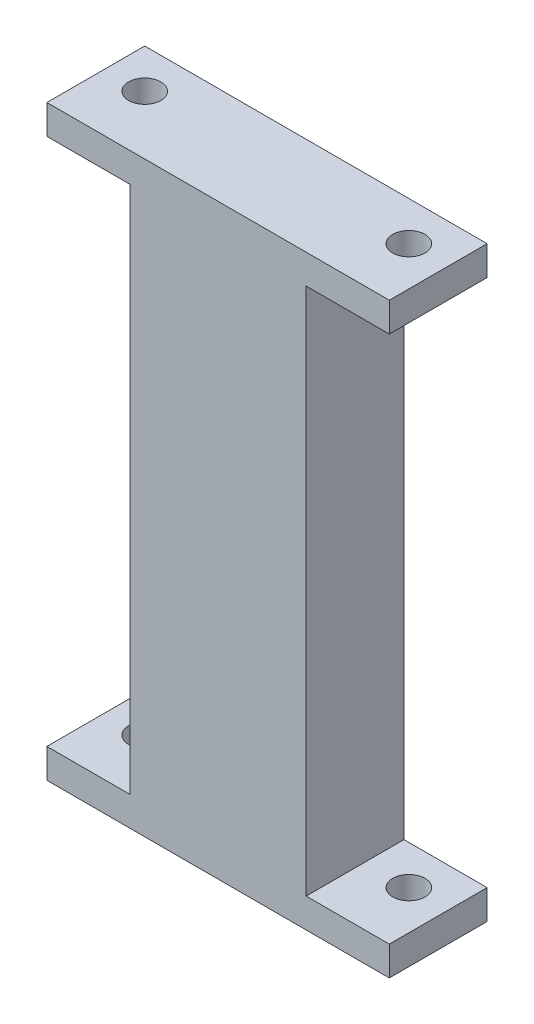
ISO-10303-21;
HEADER;
FILE_DESCRIPTION(('STEP AP214'),'2;1');
FILE_NAME('part.step','',(''),(''),'','','');
FILE_SCHEMA(('AUTOMOTIVE_DESIGN { 1 0 10303 214 1 1 1 1 }'));
ENDSEC;
DATA;
#1=APPLICATION_CONTEXT('core data for automotive mechanical design processes');
#2=APPLICATION_PROTOCOL_DEFINITION('international standard','automotive_design',2000,#1);
#3=PRODUCT_CONTEXT('',#1,'mechanical');
#4=PRODUCT('Part','Part','',(#3));
#5=PRODUCT_RELATED_PRODUCT_CATEGORY('part','',(#4));
#6=PRODUCT_DEFINITION_FORMATION('','',#4);
#7=PRODUCT_DEFINITION_CONTEXT('part definition',#1,'design');
#8=PRODUCT_DEFINITION('design','',#6,#7);
#9=PRODUCT_DEFINITION_SHAPE('','',#8);
#10=(LENGTH_UNIT() NAMED_UNIT(*) SI_UNIT(.MILLI.,.METRE.));
#11=(NAMED_UNIT(*) PLANE_ANGLE_UNIT() SI_UNIT($,.RADIAN.));
#12=(NAMED_UNIT(*) SI_UNIT($,.STERADIAN.) SOLID_ANGLE_UNIT());
#13=UNCERTAINTY_MEASURE_WITH_UNIT(LENGTH_MEASURE(1.E-05),#10,'distance_accuracy_value','');
#14=(GEOMETRIC_REPRESENTATION_CONTEXT(3) GLOBAL_UNCERTAINTY_ASSIGNED_CONTEXT((#13)) GLOBAL_UNIT_ASSIGNED_CONTEXT((#10,
#11,#12)) REPRESENTATION_CONTEXT('',''));
#15=CARTESIAN_POINT('',(0.,0.,0.));
#16=DIRECTION('',(0.,0.,1.));
#17=DIRECTION('',(1.,0.,0.));
#18=AXIS2_PLACEMENT_3D('',#15,#16,#17);
#19=CARTESIAN_POINT('',(0.,1.5,0.));
#20=DIRECTION('',(0.,-1.,0.));
#21=DIRECTION('',(0.,0.,-1.));
#22=AXIS2_PLACEMENT_3D('',#19,#20,#21);
#23=PLANE('',#22);
#24=CARTESIAN_POINT('',(-13.5,1.5,-0.999999999999997));
#25=DIRECTION('',(0.,1.,0.));
#26=DIRECTION('',(0.,0.,1.));
#27=AXIS2_PLACEMENT_3D('',#24,#25,#26);
#28=CIRCLE('',#27,1.65);
#29=CARTESIAN_POINT('',(-13.5,1.5,0.650000000000004));
#30=VERTEX_POINT('',#29);
#31=EDGE_CURVE('E196',#30,#30,#28,.T.);
#32=ORIENTED_EDGE('',*,*,#31,.F.);
#33=EDGE_LOOP('',(#32));
#34=FACE_BOUND('',#33,.T.);
#35=DIRECTION('',(0.,0.,1.));
#36=VECTOR('',#35,1.);
#37=CARTESIAN_POINT('',(-9.,1.5,-5.));
#38=LINE('',#37,#36);
#39=CARTESIAN_POINT('',(-9.,1.5,-5.));
#40=VERTEX_POINT('',#39);
#41=CARTESIAN_POINT('',(-9.,1.5,5.));
#42=VERTEX_POINT('',#41);
#43=EDGE_CURVE('E146',#40,#42,#38,.T.);
#44=ORIENTED_EDGE('',*,*,#43,.F.);
#45=DIRECTION('',(-1.,0.,0.));
#46=VECTOR('',#45,1.);
#47=CARTESIAN_POINT('',(-17.5,1.5,-5.));
#48=LINE('',#47,#46);
#49=CARTESIAN_POINT('',(-17.5,1.5,-5.));
#50=VERTEX_POINT('',#49);
#51=EDGE_CURVE('E211',#40,#50,#48,.T.);
#52=ORIENTED_EDGE('',*,*,#51,.T.);
#53=DIRECTION('',(0.,0.,1.));
#54=VECTOR('',#53,1.);
#55=CARTESIAN_POINT('',(-17.5,1.5,5.));
#56=LINE('',#55,#54);
#57=CARTESIAN_POINT('',(-17.5,1.5,5.));
#58=VERTEX_POINT('',#57);
#59=EDGE_CURVE('E215',#50,#58,#56,.T.);
#60=ORIENTED_EDGE('',*,*,#59,.T.);
#61=DIRECTION('',(1.,0.,0.));
#62=VECTOR('',#61,1.);
#63=CARTESIAN_POINT('',(-17.5,1.5,5.));
#64=LINE('',#63,#62);
#65=EDGE_CURVE('E59',#58,#42,#64,.T.);
#66=ORIENTED_EDGE('',*,*,#65,.T.);
#67=EDGE_LOOP('',(#44,#52,#60,#66));
#68=FACE_BOUND('',#67,.T.);
#69=ADVANCED_FACE('F36',(#34,#68),#23,.F.);
#70=CARTESIAN_POINT('',(13.5,1.5,-1.));
#71=DIRECTION('',(0.,1.,0.));
#72=DIRECTION('',(0.,0.,-1.));
#73=AXIS2_PLACEMENT_3D('',#70,#71,#72);
#74=CIRCLE('',#73,1.65);
#75=CARTESIAN_POINT('',(13.5,1.5,-2.65));
#76=VERTEX_POINT('',#75);
#77=EDGE_CURVE('E195',#76,#76,#74,.T.);
#78=ORIENTED_EDGE('',*,*,#77,.F.);
#79=EDGE_LOOP('',(#78));
#80=FACE_BOUND('',#79,.T.);
#81=DIRECTION('',(0.,0.,-1.));
#82=VECTOR('',#81,1.);
#83=CARTESIAN_POINT('',(9.,1.5,-5.));
#84=LINE('',#83,#82);
#85=CARTESIAN_POINT('',(8.99999999999999,1.5,5.));
#86=VERTEX_POINT('',#85);
#87=CARTESIAN_POINT('',(9.,1.5,-5.));
#88=VERTEX_POINT('',#87);
#89=EDGE_CURVE('E51',#86,#88,#84,.T.);
#90=ORIENTED_EDGE('',*,*,#89,.F.);
#91=CARTESIAN_POINT('',(17.5,1.5,5.));
#92=VERTEX_POINT('',#91);
#93=EDGE_CURVE('E217',#86,#92,#64,.T.);
#94=ORIENTED_EDGE('',*,*,#93,.T.);
#95=DIRECTION('',(0.,0.,-1.));
#96=VECTOR('',#95,1.);
#97=CARTESIAN_POINT('',(17.5,1.5,5.));
#98=LINE('',#97,#96);
#99=CARTESIAN_POINT('',(17.5,1.5,-5.));
#100=VERTEX_POINT('',#99);
#101=EDGE_CURVE('E208',#92,#100,#98,.T.);
#102=ORIENTED_EDGE('',*,*,#101,.T.);
#103=EDGE_CURVE('E213',#100,#88,#48,.T.);
#104=ORIENTED_EDGE('',*,*,#103,.T.);
#105=EDGE_LOOP('',(#90,#94,#102,#104));
#106=FACE_BOUND('',#105,.T.);
#107=ADVANCED_FACE('F248',(#80,#106),#23,.F.);
#108=CARTESIAN_POINT('',(17.5,1.5,5.));
#109=DIRECTION('',(-1.,0.,0.));
#110=DIRECTION('',(0.,0.,1.));
#111=AXIS2_PLACEMENT_3D('',#108,#109,#110);
#112=PLANE('',#111);
#113=DIRECTION('',(0.,0.,-1.));
#114=VECTOR('',#113,1.);
#115=CARTESIAN_POINT('',(17.5,-1.5,5.));
#116=LINE('',#115,#114);
#117=CARTESIAN_POINT('',(17.5,-1.5,5.));
#118=VERTEX_POINT('',#117);
#119=CARTESIAN_POINT('',(17.5,-1.5,-5.));
#120=VERTEX_POINT('',#119);
#121=EDGE_CURVE('E203',#118,#120,#116,.T.);
#122=ORIENTED_EDGE('',*,*,#121,.T.);
#123=DIRECTION('',(0.,-1.,0.));
#124=VECTOR('',#123,1.);
#125=CARTESIAN_POINT('',(17.5,1.5,-5.));
#126=LINE('',#125,#124);
#127=EDGE_CURVE('E11',#100,#120,#126,.T.);
#128=ORIENTED_EDGE('',*,*,#127,.F.);
#129=ORIENTED_EDGE('',*,*,#101,.F.);
#130=DIRECTION('',(0.,-1.,0.));
#131=VECTOR('',#130,1.);
#132=CARTESIAN_POINT('',(17.5,1.5,5.));
#133=LINE('',#132,#131);
#134=EDGE_CURVE('E219',#92,#118,#133,.T.);
#135=ORIENTED_EDGE('',*,*,#134,.T.);
#136=EDGE_LOOP('',(#122,#128,#129,#135));
#137=FACE_BOUND('',#136,.T.);
#138=ADVANCED_FACE('F38',(#137),#112,.F.);
#139=CARTESIAN_POINT('',(-17.5,1.5,-5.));
#140=DIRECTION('',(0.,0.,1.));
#141=DIRECTION('',(1.,0.,0.));
#142=AXIS2_PLACEMENT_3D('',#139,#140,#141);
#143=PLANE('',#142);
#144=DIRECTION('',(-1.,0.,0.));
#145=VECTOR('',#144,1.);
#146=CARTESIAN_POINT('',(-17.5,-1.5,-5.));
#147=LINE('',#146,#145);
#148=CARTESIAN_POINT('',(-17.5,-1.5,-5.));
#149=VERTEX_POINT('',#148);
#150=EDGE_CURVE('E222',#120,#149,#147,.T.);
#151=ORIENTED_EDGE('',*,*,#150,.T.);
#152=DIRECTION('',(0.,-1.,0.));
#153=VECTOR('',#152,1.);
#154=CARTESIAN_POINT('',(-17.5,1.5,-5.));
#155=LINE('',#154,#153);
#156=EDGE_CURVE('E44',#50,#149,#155,.T.);
#157=ORIENTED_EDGE('',*,*,#156,.F.);
#158=ORIENTED_EDGE('',*,*,#51,.F.);
#159=DIRECTION('',(0.,-1.,0.));
#160=VECTOR('',#159,1.);
#161=CARTESIAN_POINT('',(-9.,55.5,-5.));
#162=LINE('',#161,#160);
#163=CARTESIAN_POINT('',(-9.,55.5,-5.));
#164=VERTEX_POINT('',#163);
#165=EDGE_CURVE('E183',#164,#40,#162,.T.);
#166=ORIENTED_EDGE('',*,*,#165,.F.);
#167=DIRECTION('',(-1.,0.,0.));
#168=VECTOR('',#167,1.);
#169=CARTESIAN_POINT('',(-17.5,55.5,-5.));
#170=LINE('',#169,#168);
#171=CARTESIAN_POINT('',(-17.5,55.5,-5.));
#172=VERTEX_POINT('',#171);
#173=EDGE_CURVE('E165',#164,#172,#170,.T.);
#174=ORIENTED_EDGE('',*,*,#173,.T.);
#175=DIRECTION('',(0.,1.,0.));
#176=VECTOR('',#175,1.);
#177=CARTESIAN_POINT('',(-17.5,55.5,-5.));
#178=LINE('',#177,#176);
#179=CARTESIAN_POINT('',(-17.5,58.5,-5.));
#180=VERTEX_POINT('',#179);
#181=EDGE_CURVE('E175',#172,#180,#178,.T.);
#182=ORIENTED_EDGE('',*,*,#181,.T.);
#183=DIRECTION('',(-1.,0.,0.));
#184=VECTOR('',#183,1.);
#185=CARTESIAN_POINT('',(-17.5,58.5,-5.));
#186=LINE('',#185,#184);
#187=CARTESIAN_POINT('',(17.5,58.5,-5.));
#188=VERTEX_POINT('',#187);
#189=EDGE_CURVE('E152',#188,#180,#186,.T.);
#190=ORIENTED_EDGE('',*,*,#189,.F.);
#191=DIRECTION('',(0.,1.,0.));
#192=VECTOR('',#191,1.);
#193=CARTESIAN_POINT('',(17.5,55.5,-5.));
#194=LINE('',#193,#192);
#195=CARTESIAN_POINT('',(17.5,55.5,-5.));
#196=VERTEX_POINT('',#195);
#197=EDGE_CURVE('E167',#196,#188,#194,.T.);
#198=ORIENTED_EDGE('',*,*,#197,.F.);
#199=CARTESIAN_POINT('',(8.99999999999999,55.5,-5.));
#200=VERTEX_POINT('',#199);
#201=EDGE_CURVE('E151',#196,#200,#170,.T.);
#202=ORIENTED_EDGE('',*,*,#201,.T.);
#203=DIRECTION('',(0.,-1.,0.));
#204=VECTOR('',#203,1.);
#205=CARTESIAN_POINT('',(9.,55.5,-5.));
#206=LINE('',#205,#204);
#207=EDGE_CURVE('E189',#200,#88,#206,.T.);
#208=ORIENTED_EDGE('',*,*,#207,.T.);
#209=ORIENTED_EDGE('',*,*,#103,.F.);
#210=ORIENTED_EDGE('',*,*,#127,.T.);
#211=EDGE_LOOP('',(#151,#157,#158,#166,#174,#182,#190,#198,#202,#208,#209,#210));
#212=FACE_BOUND('',#211,.T.);
#213=ADVANCED_FACE('F251',(#212),#143,.F.);
#214=CARTESIAN_POINT('',(-17.5,1.5,5.));
#215=DIRECTION('',(1.,0.,0.));
#216=DIRECTION('',(0.,0.,-1.));
#217=AXIS2_PLACEMENT_3D('',#214,#215,#216);
#218=PLANE('',#217);
#219=DIRECTION('',(0.,0.,1.));
#220=VECTOR('',#219,1.);
#221=CARTESIAN_POINT('',(-17.5,-1.5,5.));
#222=LINE('',#221,#220);
#223=CARTESIAN_POINT('',(-17.5,-1.5,5.));
#224=VERTEX_POINT('',#223);
#225=EDGE_CURVE('E224',#149,#224,#222,.T.);
#226=ORIENTED_EDGE('',*,*,#225,.T.);
#227=DIRECTION('',(0.,-1.,0.));
#228=VECTOR('',#227,1.);
#229=CARTESIAN_POINT('',(-17.5,1.5,5.));
#230=LINE('',#229,#228);
#231=EDGE_CURVE('E229',#58,#224,#230,.T.);
#232=ORIENTED_EDGE('',*,*,#231,.F.);
#233=ORIENTED_EDGE('',*,*,#59,.F.);
#234=ORIENTED_EDGE('',*,*,#156,.T.);
#235=EDGE_LOOP('',(#226,#232,#233,#234));
#236=FACE_BOUND('',#235,.T.);
#237=ADVANCED_FACE('F236',(#236),#218,.F.);
#238=CARTESIAN_POINT('',(-17.5,1.5,5.));
#239=DIRECTION('',(0.,0.,-1.));
#240=DIRECTION('',(-1.,0.,0.));
#241=AXIS2_PLACEMENT_3D('',#238,#239,#240);
#242=PLANE('',#241);
#243=DIRECTION('',(1.,0.,0.));
#244=VECTOR('',#243,1.);
#245=CARTESIAN_POINT('',(-17.5,-1.5,5.));
#246=LINE('',#245,#244);
#247=EDGE_CURVE('E212',#224,#118,#246,.T.);
#248=ORIENTED_EDGE('',*,*,#247,.T.);
#249=ORIENTED_EDGE('',*,*,#134,.F.);
#250=ORIENTED_EDGE('',*,*,#93,.F.);
#251=DIRECTION('',(0.,-1.,0.));
#252=VECTOR('',#251,1.);
#253=CARTESIAN_POINT('',(9.,55.5,5.));
#254=LINE('',#253,#252);
#255=CARTESIAN_POINT('',(9.,55.5,5.));
#256=VERTEX_POINT('',#255);
#257=EDGE_CURVE('E131',#256,#86,#254,.T.);
#258=ORIENTED_EDGE('',*,*,#257,.F.);
#259=DIRECTION('',(1.,0.,0.));
#260=VECTOR('',#259,1.);
#261=CARTESIAN_POINT('',(-17.5,55.5,5.));
#262=LINE('',#261,#260);
#263=CARTESIAN_POINT('',(17.5,55.5,5.));
#264=VERTEX_POINT('',#263);
#265=EDGE_CURVE('E124',#256,#264,#262,.T.);
#266=ORIENTED_EDGE('',*,*,#265,.T.);
#267=DIRECTION('',(0.,1.,0.));
#268=VECTOR('',#267,1.);
#269=CARTESIAN_POINT('',(17.5,55.5,5.));
#270=LINE('',#269,#268);
#271=CARTESIAN_POINT('',(17.5,58.5,5.));
#272=VERTEX_POINT('',#271);
#273=EDGE_CURVE('E128',#264,#272,#270,.T.);
#274=ORIENTED_EDGE('',*,*,#273,.T.);
#275=DIRECTION('',(1.,0.,0.));
#276=VECTOR('',#275,1.);
#277=CARTESIAN_POINT('',(-17.5,58.5,5.));
#278=LINE('',#277,#276);
#279=CARTESIAN_POINT('',(-17.5,58.5,5.));
#280=VERTEX_POINT('',#279);
#281=EDGE_CURVE('E169',#280,#272,#278,.T.);
#282=ORIENTED_EDGE('',*,*,#281,.F.);
#283=DIRECTION('',(0.,1.,0.));
#284=VECTOR('',#283,1.);
#285=CARTESIAN_POINT('',(-17.5,55.5,5.));
#286=LINE('',#285,#284);
#287=CARTESIAN_POINT('',(-17.5,55.5,5.));
#288=VERTEX_POINT('',#287);
#289=EDGE_CURVE('E147',#288,#280,#286,.T.);
#290=ORIENTED_EDGE('',*,*,#289,.F.);
#291=CARTESIAN_POINT('',(-9.,55.5,5.));
#292=VERTEX_POINT('',#291);
#293=EDGE_CURVE('E136',#288,#292,#262,.T.);
#294=ORIENTED_EDGE('',*,*,#293,.T.);
#295=DIRECTION('',(0.,-1.,0.));
#296=VECTOR('',#295,1.);
#297=CARTESIAN_POINT('',(-9.,55.5,5.));
#298=LINE('',#297,#296);
#299=EDGE_CURVE('E193',#292,#42,#298,.T.);
#300=ORIENTED_EDGE('',*,*,#299,.T.);
#301=ORIENTED_EDGE('',*,*,#65,.F.);
#302=ORIENTED_EDGE('',*,*,#231,.T.);
#303=EDGE_LOOP('',(#248,#249,#250,#258,#266,#274,#282,#290,#294,#300,#301,#302));
#304=FACE_BOUND('',#303,.T.);
#305=ADVANCED_FACE('F126',(#304),#242,.F.);
#306=CARTESIAN_POINT('',(0.,-1.5,0.));
#307=DIRECTION('',(0.,-1.,0.));
#308=DIRECTION('',(0.,0.,-1.));
#309=AXIS2_PLACEMENT_3D('',#306,#307,#308);
#310=PLANE('',#309);
#311=CARTESIAN_POINT('',(-13.5,-1.5,-0.999999999999997));
#312=DIRECTION('',(0.,-1.,0.));
#313=DIRECTION('',(0.,0.,-1.));
#314=AXIS2_PLACEMENT_3D('',#311,#312,#313);
#315=CIRCLE('',#314,1.65);
#316=CARTESIAN_POINT('',(-13.5,-1.5,-2.65));
#317=VERTEX_POINT('',#316);
#318=EDGE_CURVE('E199',#317,#317,#315,.F.);
#319=ORIENTED_EDGE('',*,*,#318,.T.);
#320=EDGE_LOOP('',(#319));
#321=FACE_BOUND('',#320,.T.);
#322=CARTESIAN_POINT('',(13.5,-1.5,-1.));
#323=DIRECTION('',(0.,-1.,0.));
#324=DIRECTION('',(0.,0.,-1.));
#325=AXIS2_PLACEMENT_3D('',#322,#323,#324);
#326=CIRCLE('',#325,1.65);
#327=CARTESIAN_POINT('',(13.5,-1.5,-2.65));
#328=VERTEX_POINT('',#327);
#329=EDGE_CURVE('E200',#328,#328,#326,.F.);
#330=ORIENTED_EDGE('',*,*,#329,.T.);
#331=EDGE_LOOP('',(#330));
#332=FACE_BOUND('',#331,.T.);
#333=ORIENTED_EDGE('',*,*,#121,.F.);
#334=ORIENTED_EDGE('',*,*,#247,.F.);
#335=ORIENTED_EDGE('',*,*,#225,.F.);
#336=ORIENTED_EDGE('',*,*,#150,.F.);
#337=EDGE_LOOP('',(#333,#334,#335,#336));
#338=FACE_BOUND('',#337,.T.);
#339=ADVANCED_FACE('F243',(#321,#332,#338),#310,.T.);
#340=CARTESIAN_POINT('',(13.5,-6.16690475583122,-1.));
#341=DIRECTION('',(0.,1.,0.));
#342=DIRECTION('',(0.,0.,1.));
#343=AXIS2_PLACEMENT_3D('',#340,#341,#342);
#344=CYLINDRICAL_SURFACE('',#343,1.65);
#345=ORIENTED_EDGE('',*,*,#77,.T.);
#346=EDGE_LOOP('',(#345));
#347=FACE_BOUND('',#346,.T.);
#348=ORIENTED_EDGE('',*,*,#329,.F.);
#349=EDGE_LOOP('',(#348));
#350=FACE_BOUND('',#349,.T.);
#351=ADVANCED_FACE('F277',(#347,#350),#344,.F.);
#352=CARTESIAN_POINT('',(-13.5,-6.16690475583122,-0.999999999999997));
#353=DIRECTION('',(0.,1.,0.));
#354=DIRECTION('',(0.,0.,1.));
#355=AXIS2_PLACEMENT_3D('',#352,#353,#354);
#356=CYLINDRICAL_SURFACE('',#355,1.65);
#357=ORIENTED_EDGE('',*,*,#31,.T.);
#358=EDGE_LOOP('',(#357));
#359=FACE_BOUND('',#358,.T.);
#360=ORIENTED_EDGE('',*,*,#318,.F.);
#361=EDGE_LOOP('',(#360));
#362=FACE_BOUND('',#361,.T.);
#363=ADVANCED_FACE('F323',(#359,#362),#356,.F.);
#364=CARTESIAN_POINT('',(-9.,55.5,-5.));
#365=DIRECTION('',(1.,0.,0.));
#366=DIRECTION('',(0.,0.,-1.));
#367=AXIS2_PLACEMENT_3D('',#364,#365,#366);
#368=PLANE('',#367);
#369=ORIENTED_EDGE('',*,*,#43,.T.);
#370=ORIENTED_EDGE('',*,*,#299,.F.);
#371=DIRECTION('',(0.,0.,1.));
#372=VECTOR('',#371,1.);
#373=CARTESIAN_POINT('',(-9.,55.5,-5.));
#374=LINE('',#373,#372);
#375=EDGE_CURVE('E178',#164,#292,#374,.T.);
#376=ORIENTED_EDGE('',*,*,#375,.F.);
#377=ORIENTED_EDGE('',*,*,#165,.T.);
#378=EDGE_LOOP('',(#369,#370,#376,#377));
#379=FACE_BOUND('',#378,.T.);
#380=ADVANCED_FACE('F266',(#379),#368,.F.);
#381=CARTESIAN_POINT('',(9.,55.5,-5.));
#382=DIRECTION('',(-1.,0.,0.));
#383=DIRECTION('',(0.,0.,1.));
#384=AXIS2_PLACEMENT_3D('',#381,#382,#383);
#385=PLANE('',#384);
#386=ORIENTED_EDGE('',*,*,#89,.T.);
#387=ORIENTED_EDGE('',*,*,#207,.F.);
#388=DIRECTION('',(0.,0.,-1.));
#389=VECTOR('',#388,1.);
#390=CARTESIAN_POINT('',(9.,55.5,-5.));
#391=LINE('',#390,#389);
#392=EDGE_CURVE('E181',#256,#200,#391,.T.);
#393=ORIENTED_EDGE('',*,*,#392,.F.);
#394=ORIENTED_EDGE('',*,*,#257,.T.);
#395=EDGE_LOOP('',(#386,#387,#393,#394));
#396=FACE_BOUND('',#395,.T.);
#397=ADVANCED_FACE('F250',(#396),#385,.F.);
#398=CARTESIAN_POINT('',(0.,55.5,0.));
#399=DIRECTION('',(0.,1.,0.));
#400=DIRECTION('',(0.,0.,-1.));
#401=AXIS2_PLACEMENT_3D('',#398,#399,#400);
#402=PLANE('',#401);
#403=CARTESIAN_POINT('',(-13.5,55.5,-0.999999999999997));
#404=DIRECTION('',(0.,1.,0.));
#405=DIRECTION('',(0.,0.,1.));
#406=AXIS2_PLACEMENT_3D('',#403,#404,#405);
#407=CIRCLE('',#406,1.65);
#408=CARTESIAN_POINT('',(-13.5,55.5,0.650000000000004));
#409=VERTEX_POINT('',#408);
#410=EDGE_CURVE('E443',#409,#409,#407,.T.);
#411=ORIENTED_EDGE('',*,*,#410,.T.);
#412=EDGE_LOOP('',(#411));
#413=FACE_BOUND('',#412,.T.);
#414=ORIENTED_EDGE('',*,*,#173,.F.);
#415=ORIENTED_EDGE('',*,*,#375,.T.);
#416=ORIENTED_EDGE('',*,*,#293,.F.);
#417=DIRECTION('',(0.,0.,1.));
#418=VECTOR('',#417,1.);
#419=CARTESIAN_POINT('',(-17.5,55.5,5.));
#420=LINE('',#419,#418);
#421=EDGE_CURVE('E162',#172,#288,#420,.T.);
#422=ORIENTED_EDGE('',*,*,#421,.F.);
#423=EDGE_LOOP('',(#414,#415,#416,#422));
#424=FACE_BOUND('',#423,.T.);
#425=ADVANCED_FACE('F261',(#413,#424),#402,.F.);
#426=CARTESIAN_POINT('',(13.5,55.5,-1.));
#427=DIRECTION('',(0.,1.,0.));
#428=DIRECTION('',(0.,0.,-1.));
#429=AXIS2_PLACEMENT_3D('',#426,#427,#428);
#430=CIRCLE('',#429,1.65);
#431=CARTESIAN_POINT('',(13.5,55.5,-2.65));
#432=VERTEX_POINT('',#431);
#433=EDGE_CURVE('E448',#432,#432,#430,.T.);
#434=ORIENTED_EDGE('',*,*,#433,.T.);
#435=EDGE_LOOP('',(#434));
#436=FACE_BOUND('',#435,.T.);
#437=ORIENTED_EDGE('',*,*,#265,.F.);
#438=ORIENTED_EDGE('',*,*,#392,.T.);
#439=ORIENTED_EDGE('',*,*,#201,.F.);
#440=DIRECTION('',(0.,0.,-1.));
#441=VECTOR('',#440,1.);
#442=CARTESIAN_POINT('',(17.5,55.5,5.));
#443=LINE('',#442,#441);
#444=EDGE_CURVE('E137',#264,#196,#443,.T.);
#445=ORIENTED_EDGE('',*,*,#444,.F.);
#446=EDGE_LOOP('',(#437,#438,#439,#445));
#447=FACE_BOUND('',#446,.T.);
#448=ADVANCED_FACE('F149',(#436,#447),#402,.F.);
#449=CARTESIAN_POINT('',(17.5,55.5,5.));
#450=DIRECTION('',(1.,0.,0.));
#451=DIRECTION('',(0.,0.,-1.));
#452=AXIS2_PLACEMENT_3D('',#449,#450,#451);
#453=PLANE('',#452);
#454=DIRECTION('',(0.,0.,-1.));
#455=VECTOR('',#454,1.);
#456=CARTESIAN_POINT('',(17.5,58.5,5.));
#457=LINE('',#456,#455);
#458=EDGE_CURVE('E144',#272,#188,#457,.T.);
#459=ORIENTED_EDGE('',*,*,#458,.F.);
#460=ORIENTED_EDGE('',*,*,#273,.F.);
#461=ORIENTED_EDGE('',*,*,#444,.T.);
#462=ORIENTED_EDGE('',*,*,#197,.T.);
#463=EDGE_LOOP('',(#459,#460,#461,#462));
#464=FACE_BOUND('',#463,.T.);
#465=ADVANCED_FACE('F141',(#464),#453,.T.);
#466=CARTESIAN_POINT('',(-17.5,55.5,5.));
#467=DIRECTION('',(-1.,0.,0.));
#468=DIRECTION('',(0.,0.,1.));
#469=AXIS2_PLACEMENT_3D('',#466,#467,#468);
#470=PLANE('',#469);
#471=DIRECTION('',(0.,0.,1.));
#472=VECTOR('',#471,1.);
#473=CARTESIAN_POINT('',(-17.5,58.5,5.));
#474=LINE('',#473,#472);
#475=EDGE_CURVE('E155',#180,#280,#474,.T.);
#476=ORIENTED_EDGE('',*,*,#475,.F.);
#477=ORIENTED_EDGE('',*,*,#181,.F.);
#478=ORIENTED_EDGE('',*,*,#421,.T.);
#479=ORIENTED_EDGE('',*,*,#289,.T.);
#480=EDGE_LOOP('',(#476,#477,#478,#479));
#481=FACE_BOUND('',#480,.T.);
#482=ADVANCED_FACE('F264',(#481),#470,.T.);
#483=CARTESIAN_POINT('',(0.,58.5,0.));
#484=DIRECTION('',(0.,1.,0.));
#485=DIRECTION('',(0.,0.,-1.));
#486=AXIS2_PLACEMENT_3D('',#483,#484,#485);
#487=PLANE('',#486);
#488=CARTESIAN_POINT('',(-13.5,58.5,-0.999999999999997));
#489=DIRECTION('',(0.,1.,0.));
#490=DIRECTION('',(0.,0.,1.));
#491=AXIS2_PLACEMENT_3D('',#488,#489,#490);
#492=CIRCLE('',#491,1.65);
#493=CARTESIAN_POINT('',(-13.5,58.5,0.650000000000004));
#494=VERTEX_POINT('',#493);
#495=EDGE_CURVE('E170',#494,#494,#492,.T.);
#496=ORIENTED_EDGE('',*,*,#495,.F.);
#497=EDGE_LOOP('',(#496));
#498=FACE_BOUND('',#497,.T.);
#499=CARTESIAN_POINT('',(13.5,58.5,-1.));
#500=DIRECTION('',(0.,1.,0.));
#501=DIRECTION('',(0.,0.,1.));
#502=AXIS2_PLACEMENT_3D('',#499,#500,#501);
#503=CIRCLE('',#502,1.65);
#504=CARTESIAN_POINT('',(13.5,58.5,0.650000000000003));
#505=VERTEX_POINT('',#504);
#506=EDGE_CURVE('E158',#505,#505,#503,.T.);
#507=ORIENTED_EDGE('',*,*,#506,.F.);
#508=EDGE_LOOP('',(#507));
#509=FACE_BOUND('',#508,.T.);
#510=ORIENTED_EDGE('',*,*,#458,.T.);
#511=ORIENTED_EDGE('',*,*,#189,.T.);
#512=ORIENTED_EDGE('',*,*,#475,.T.);
#513=ORIENTED_EDGE('',*,*,#281,.T.);
#514=EDGE_LOOP('',(#510,#511,#512,#513));
#515=FACE_BOUND('',#514,.T.);
#516=ADVANCED_FACE('F254',(#498,#509,#515),#487,.T.);
#517=CARTESIAN_POINT('',(13.5,117.166904755831,-1.));
#518=DIRECTION('',(0.,-1.,0.));
#519=DIRECTION('',(0.,0.,-1.));
#520=AXIS2_PLACEMENT_3D('',#517,#518,#519);
#521=CYLINDRICAL_SURFACE('',#520,1.65);
#522=ORIENTED_EDGE('',*,*,#433,.F.);
#523=EDGE_LOOP('',(#522));
#524=FACE_BOUND('',#523,.T.);
#525=ORIENTED_EDGE('',*,*,#506,.T.);
#526=EDGE_LOOP('',(#525));
#527=FACE_BOUND('',#526,.T.);
#528=ADVANCED_FACE('F372',(#524,#527),#521,.F.);
#529=CARTESIAN_POINT('',(-13.5,117.166904755831,-0.999999999999997));
#530=DIRECTION('',(0.,-1.,0.));
#531=DIRECTION('',(0.,0.,-1.));
#532=AXIS2_PLACEMENT_3D('',#529,#530,#531);
#533=CYLINDRICAL_SURFACE('',#532,1.65);
#534=ORIENTED_EDGE('',*,*,#410,.F.);
#535=EDGE_LOOP('',(#534));
#536=FACE_BOUND('',#535,.T.);
#537=ORIENTED_EDGE('',*,*,#495,.T.);
#538=EDGE_LOOP('',(#537));
#539=FACE_BOUND('',#538,.T.);
#540=ADVANCED_FACE('F382',(#536,#539),#533,.F.);
#541=CLOSED_SHELL('',(#69,#107,#138,#213,#237,#305,#339,#351,#363,#380,#397,#425,#448,#465,#482,
#516,#528,#540));
#542=MANIFOLD_SOLID_BREP('B2',#541);
#543=ADVANCED_BREP_SHAPE_REPRESENTATION('',(#18,#542),#14);
#544=SHAPE_DEFINITION_REPRESENTATION(#9,#543);
ENDSEC;
END-ISO-10303-21;
